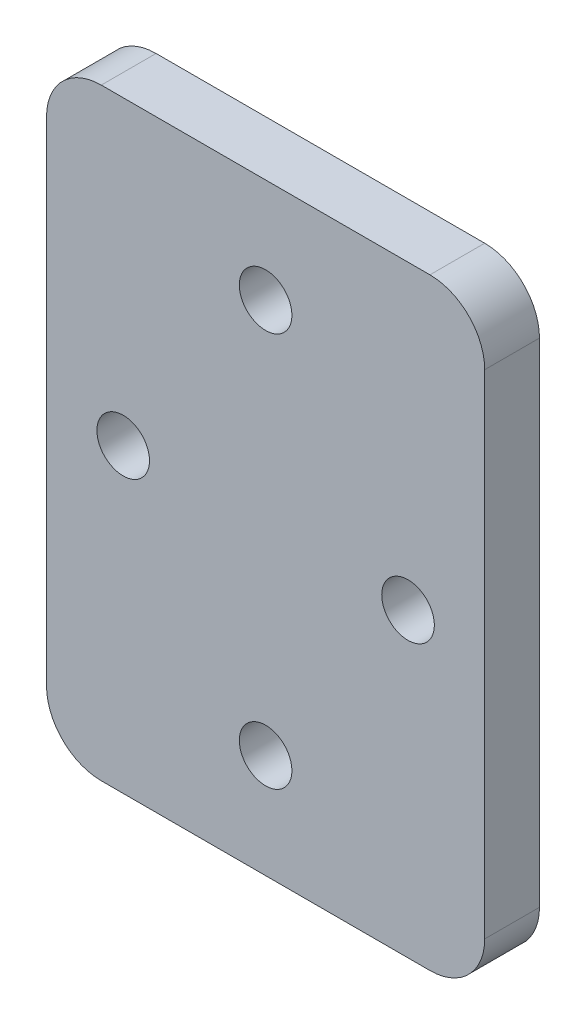
ISO-10303-21;
HEADER;
FILE_DESCRIPTION(('STEP AP214'),'2;1');
FILE_NAME('part.step','',(''),(''),'','','');
FILE_SCHEMA(('AUTOMOTIVE_DESIGN { 1 0 10303 214 1 1 1 1 }'));
ENDSEC;
DATA;
#1=APPLICATION_CONTEXT('core data for automotive mechanical design processes');
#2=APPLICATION_PROTOCOL_DEFINITION('international standard','automotive_design',2000,#1);
#3=PRODUCT_CONTEXT('',#1,'mechanical');
#4=PRODUCT('Part','Part','',(#3));
#5=PRODUCT_RELATED_PRODUCT_CATEGORY('part','',(#4));
#6=PRODUCT_DEFINITION_FORMATION('','',#4);
#7=PRODUCT_DEFINITION_CONTEXT('part definition',#1,'design');
#8=PRODUCT_DEFINITION('design','',#6,#7);
#9=PRODUCT_DEFINITION_SHAPE('','',#8);
#10=(LENGTH_UNIT() NAMED_UNIT(*) SI_UNIT(.MILLI.,.METRE.));
#11=(NAMED_UNIT(*) PLANE_ANGLE_UNIT() SI_UNIT($,.RADIAN.));
#12=(NAMED_UNIT(*) SI_UNIT($,.STERADIAN.) SOLID_ANGLE_UNIT());
#13=UNCERTAINTY_MEASURE_WITH_UNIT(LENGTH_MEASURE(1.E-05),#10,'distance_accuracy_value','');
#14=(GEOMETRIC_REPRESENTATION_CONTEXT(3) GLOBAL_UNCERTAINTY_ASSIGNED_CONTEXT((#13)) GLOBAL_UNIT_ASSIGNED_CONTEXT((#10,
#11,#12)) REPRESENTATION_CONTEXT('',''));
#15=CARTESIAN_POINT('',(0.,0.,0.));
#16=DIRECTION('',(0.,0.,1.));
#17=DIRECTION('',(1.,0.,0.));
#18=AXIS2_PLACEMENT_3D('',#15,#16,#17);
#19=CARTESIAN_POINT('',(0.,0.,5.));
#20=DIRECTION('',(0.,0.,1.));
#21=DIRECTION('',(1.,0.,0.));
#22=AXIS2_PLACEMENT_3D('',#19,#20,#21);
#23=PLANE('',#22);
#24=CARTESIAN_POINT('',(0.,-18.,5.));
#25=DIRECTION('',(0.,0.,1.));
#26=DIRECTION('',(-1.,0.,0.));
#27=AXIS2_PLACEMENT_3D('',#24,#25,#26);
#28=CIRCLE('',#27,2.4);
#29=CARTESIAN_POINT('',(-2.4,-18.,5.));
#30=VERTEX_POINT('',#29);
#31=EDGE_CURVE('E191',#30,#30,#28,.T.);
#32=ORIENTED_EDGE('',*,*,#31,.F.);
#33=EDGE_LOOP('',(#32));
#34=FACE_BOUND('',#33,.T.);
#35=CARTESIAN_POINT('',(0.,18.,5.));
#36=DIRECTION('',(0.,0.,1.));
#37=DIRECTION('',(1.,0.,0.));
#38=AXIS2_PLACEMENT_3D('',#35,#36,#37);
#39=CIRCLE('',#38,2.4);
#40=CARTESIAN_POINT('',(2.4,18.,5.));
#41=VERTEX_POINT('',#40);
#42=EDGE_CURVE('E129',#41,#41,#39,.T.);
#43=ORIENTED_EDGE('',*,*,#42,.F.);
#44=EDGE_LOOP('',(#43));
#45=FACE_BOUND('',#44,.T.);
#46=DIRECTION('',(1.,0.,0.));
#47=VECTOR('',#46,1.);
#48=CARTESIAN_POINT('',(-20.,-27.5,5.));
#49=LINE('',#48,#47);
#50=CARTESIAN_POINT('',(-15.,-27.5,5.));
#51=VERTEX_POINT('',#50);
#52=CARTESIAN_POINT('',(15.,-27.5,5.));
#53=VERTEX_POINT('',#52);
#54=EDGE_CURVE('E138',#51,#53,#49,.T.);
#55=ORIENTED_EDGE('',*,*,#54,.T.);
#56=CARTESIAN_POINT('',(15.,-22.5,5.));
#57=DIRECTION('',(0.,0.,1.));
#58=DIRECTION('',(1.,0.,0.));
#59=AXIS2_PLACEMENT_3D('',#56,#57,#58);
#60=CIRCLE('',#59,5.);
#61=CARTESIAN_POINT('',(20.,-22.5,5.));
#62=VERTEX_POINT('',#61);
#63=EDGE_CURVE('E156',#53,#62,#60,.T.);
#64=ORIENTED_EDGE('',*,*,#63,.T.);
#65=DIRECTION('',(0.,1.,0.));
#66=VECTOR('',#65,1.);
#67=CARTESIAN_POINT('',(20.,27.5,5.));
#68=LINE('',#67,#66);
#69=CARTESIAN_POINT('',(20.,22.5,5.));
#70=VERTEX_POINT('',#69);
#71=EDGE_CURVE('E120',#62,#70,#68,.T.);
#72=ORIENTED_EDGE('',*,*,#71,.T.);
#73=CARTESIAN_POINT('',(15.,22.5,5.));
#74=DIRECTION('',(0.,0.,1.));
#75=DIRECTION('',(1.,0.,0.));
#76=AXIS2_PLACEMENT_3D('',#73,#74,#75);
#77=CIRCLE('',#76,5.);
#78=CARTESIAN_POINT('',(15.,27.5,5.));
#79=VERTEX_POINT('',#78);
#80=EDGE_CURVE('E152',#70,#79,#77,.T.);
#81=ORIENTED_EDGE('',*,*,#80,.T.);
#82=DIRECTION('',(-1.,0.,0.));
#83=VECTOR('',#82,1.);
#84=CARTESIAN_POINT('',(-20.,27.5,5.));
#85=LINE('',#84,#83);
#86=CARTESIAN_POINT('',(-15.,27.5,5.));
#87=VERTEX_POINT('',#86);
#88=EDGE_CURVE('E165',#79,#87,#85,.T.);
#89=ORIENTED_EDGE('',*,*,#88,.T.);
#90=CARTESIAN_POINT('',(-15.,22.5,5.));
#91=DIRECTION('',(0.,0.,1.));
#92=DIRECTION('',(1.,0.,0.));
#93=AXIS2_PLACEMENT_3D('',#90,#91,#92);
#94=CIRCLE('',#93,5.);
#95=CARTESIAN_POINT('',(-20.,22.5,5.));
#96=VERTEX_POINT('',#95);
#97=EDGE_CURVE('E55',#87,#96,#94,.T.);
#98=ORIENTED_EDGE('',*,*,#97,.T.);
#99=DIRECTION('',(0.,-1.,0.));
#100=VECTOR('',#99,1.);
#101=CARTESIAN_POINT('',(-20.,27.5,5.));
#102=LINE('',#101,#100);
#103=CARTESIAN_POINT('',(-20.,-22.5,5.));
#104=VERTEX_POINT('',#103);
#105=EDGE_CURVE('E171',#96,#104,#102,.T.);
#106=ORIENTED_EDGE('',*,*,#105,.T.);
#107=CARTESIAN_POINT('',(-15.,-22.5,5.));
#108=DIRECTION('',(0.,0.,1.));
#109=DIRECTION('',(1.,0.,0.));
#110=AXIS2_PLACEMENT_3D('',#107,#108,#109);
#111=CIRCLE('',#110,5.);
#112=EDGE_CURVE('E154',#104,#51,#111,.T.);
#113=ORIENTED_EDGE('',*,*,#112,.T.);
#114=EDGE_LOOP('',(#55,#64,#72,#81,#89,#98,#106,#113));
#115=FACE_BOUND('',#114,.T.);
#116=CARTESIAN_POINT('',(-13.,0.,5.));
#117=DIRECTION('',(0.,0.,1.));
#118=DIRECTION('',(1.,0.,0.));
#119=AXIS2_PLACEMENT_3D('',#116,#117,#118);
#120=CIRCLE('',#119,2.4);
#121=CARTESIAN_POINT('',(-10.6,0.,5.));
#122=VERTEX_POINT('',#121);
#123=EDGE_CURVE('E186',#122,#122,#120,.T.);
#124=ORIENTED_EDGE('',*,*,#123,.F.);
#125=EDGE_LOOP('',(#124));
#126=FACE_BOUND('',#125,.T.);
#127=CARTESIAN_POINT('',(13.,0.,5.));
#128=DIRECTION('',(0.,0.,1.));
#129=DIRECTION('',(-1.,0.,0.));
#130=AXIS2_PLACEMENT_3D('',#127,#128,#129);
#131=CIRCLE('',#130,2.4);
#132=CARTESIAN_POINT('',(10.6,0.,5.));
#133=VERTEX_POINT('',#132);
#134=EDGE_CURVE('E197',#133,#133,#131,.T.);
#135=ORIENTED_EDGE('',*,*,#134,.F.);
#136=EDGE_LOOP('',(#135));
#137=FACE_BOUND('',#136,.T.);
#138=ADVANCED_FACE('F33',(#34,#45,#115,#126,#137),#23,.T.);
#139=CARTESIAN_POINT('',(0.,0.,0.));
#140=DIRECTION('',(0.,0.,1.));
#141=DIRECTION('',(1.,0.,0.));
#142=AXIS2_PLACEMENT_3D('',#139,#140,#141);
#143=PLANE('',#142);
#144=DIRECTION('',(0.,1.,0.));
#145=VECTOR('',#144,1.);
#146=CARTESIAN_POINT('',(20.,27.5,0.));
#147=LINE('',#146,#145);
#148=CARTESIAN_POINT('',(20.,-22.5,0.));
#149=VERTEX_POINT('',#148);
#150=CARTESIAN_POINT('',(20.,22.5,0.));
#151=VERTEX_POINT('',#150);
#152=EDGE_CURVE('E117',#149,#151,#147,.T.);
#153=ORIENTED_EDGE('',*,*,#152,.F.);
#154=CARTESIAN_POINT('',(15.,-22.5,0.));
#155=DIRECTION('',(0.,0.,1.));
#156=DIRECTION('',(1.,0.,0.));
#157=AXIS2_PLACEMENT_3D('',#154,#155,#156);
#158=CIRCLE('',#157,5.);
#159=CARTESIAN_POINT('',(15.,-27.5,0.));
#160=VERTEX_POINT('',#159);
#161=EDGE_CURVE('E100',#149,#160,#158,.F.);
#162=ORIENTED_EDGE('',*,*,#161,.T.);
#163=DIRECTION('',(1.,0.,0.));
#164=VECTOR('',#163,1.);
#165=CARTESIAN_POINT('',(-20.,-27.5,0.));
#166=LINE('',#165,#164);
#167=CARTESIAN_POINT('',(-15.,-27.5,0.));
#168=VERTEX_POINT('',#167);
#169=EDGE_CURVE('E142',#168,#160,#166,.T.);
#170=ORIENTED_EDGE('',*,*,#169,.F.);
#171=CARTESIAN_POINT('',(-15.,-22.5,0.));
#172=DIRECTION('',(0.,0.,1.));
#173=DIRECTION('',(1.,0.,0.));
#174=AXIS2_PLACEMENT_3D('',#171,#172,#173);
#175=CIRCLE('',#174,5.);
#176=CARTESIAN_POINT('',(-20.,-22.5,0.));
#177=VERTEX_POINT('',#176);
#178=EDGE_CURVE('E111',#168,#177,#175,.F.);
#179=ORIENTED_EDGE('',*,*,#178,.T.);
#180=DIRECTION('',(0.,-1.,0.));
#181=VECTOR('',#180,1.);
#182=CARTESIAN_POINT('',(-20.,27.5,0.));
#183=LINE('',#182,#181);
#184=CARTESIAN_POINT('',(-20.,22.5,0.));
#185=VERTEX_POINT('',#184);
#186=EDGE_CURVE('E132',#185,#177,#183,.T.);
#187=ORIENTED_EDGE('',*,*,#186,.F.);
#188=CARTESIAN_POINT('',(-15.,22.5,0.));
#189=DIRECTION('',(0.,0.,1.));
#190=DIRECTION('',(1.,0.,0.));
#191=AXIS2_PLACEMENT_3D('',#188,#189,#190);
#192=CIRCLE('',#191,5.);
#193=CARTESIAN_POINT('',(-15.,27.5,0.));
#194=VERTEX_POINT('',#193);
#195=EDGE_CURVE('E121',#185,#194,#192,.F.);
#196=ORIENTED_EDGE('',*,*,#195,.T.);
#197=DIRECTION('',(-1.,0.,0.));
#198=VECTOR('',#197,1.);
#199=CARTESIAN_POINT('',(-20.,27.5,0.));
#200=LINE('',#199,#198);
#201=CARTESIAN_POINT('',(15.,27.5,0.));
#202=VERTEX_POINT('',#201);
#203=EDGE_CURVE('E128',#202,#194,#200,.T.);
#204=ORIENTED_EDGE('',*,*,#203,.F.);
#205=CARTESIAN_POINT('',(15.,22.5,0.));
#206=DIRECTION('',(0.,0.,1.));
#207=DIRECTION('',(1.,0.,0.));
#208=AXIS2_PLACEMENT_3D('',#205,#206,#207);
#209=CIRCLE('',#208,5.);
#210=EDGE_CURVE('E127',#202,#151,#209,.F.);
#211=ORIENTED_EDGE('',*,*,#210,.T.);
#212=EDGE_LOOP('',(#153,#162,#170,#179,#187,#196,#204,#211));
#213=FACE_BOUND('',#212,.T.);
#214=CARTESIAN_POINT('',(0.,18.,0.));
#215=DIRECTION('',(0.,0.,1.));
#216=DIRECTION('',(1.,0.,0.));
#217=AXIS2_PLACEMENT_3D('',#214,#215,#216);
#218=CIRCLE('',#217,2.4);
#219=CARTESIAN_POINT('',(2.4,18.,0.));
#220=VERTEX_POINT('',#219);
#221=EDGE_CURVE('E135',#220,#220,#218,.T.);
#222=ORIENTED_EDGE('',*,*,#221,.T.);
#223=EDGE_LOOP('',(#222));
#224=FACE_BOUND('',#223,.T.);
#225=CARTESIAN_POINT('',(-13.,0.,0.));
#226=DIRECTION('',(0.,0.,1.));
#227=DIRECTION('',(1.,0.,0.));
#228=AXIS2_PLACEMENT_3D('',#225,#226,#227);
#229=CIRCLE('',#228,2.4);
#230=CARTESIAN_POINT('',(-10.6,0.,0.));
#231=VERTEX_POINT('',#230);
#232=EDGE_CURVE('E188',#231,#231,#229,.T.);
#233=ORIENTED_EDGE('',*,*,#232,.T.);
#234=EDGE_LOOP('',(#233));
#235=FACE_BOUND('',#234,.T.);
#236=CARTESIAN_POINT('',(0.,-18.,0.));
#237=DIRECTION('',(0.,0.,1.));
#238=DIRECTION('',(-1.,0.,0.));
#239=AXIS2_PLACEMENT_3D('',#236,#237,#238);
#240=CIRCLE('',#239,2.4);
#241=CARTESIAN_POINT('',(-2.4,-18.,0.));
#242=VERTEX_POINT('',#241);
#243=EDGE_CURVE('E194',#242,#242,#240,.T.);
#244=ORIENTED_EDGE('',*,*,#243,.T.);
#245=EDGE_LOOP('',(#244));
#246=FACE_BOUND('',#245,.T.);
#247=CARTESIAN_POINT('',(13.,0.,0.));
#248=DIRECTION('',(0.,0.,1.));
#249=DIRECTION('',(-1.,0.,0.));
#250=AXIS2_PLACEMENT_3D('',#247,#248,#249);
#251=CIRCLE('',#250,2.4);
#252=CARTESIAN_POINT('',(10.6,0.,0.));
#253=VERTEX_POINT('',#252);
#254=EDGE_CURVE('E200',#253,#253,#251,.T.);
#255=ORIENTED_EDGE('',*,*,#254,.T.);
#256=EDGE_LOOP('',(#255));
#257=FACE_BOUND('',#256,.T.);
#258=ADVANCED_FACE('F124',(#213,#224,#235,#246,#257),#143,.F.);
#259=CARTESIAN_POINT('',(20.,27.5,5.));
#260=DIRECTION('',(-1.,0.,0.));
#261=DIRECTION('',(0.,-1.,0.));
#262=AXIS2_PLACEMENT_3D('',#259,#260,#261);
#263=PLANE('',#262);
#264=ORIENTED_EDGE('',*,*,#71,.F.);
#265=DIRECTION('',(0.,0.,-1.));
#266=VECTOR('',#265,1.);
#267=CARTESIAN_POINT('',(20.,-22.5,5.));
#268=LINE('',#267,#266);
#269=EDGE_CURVE('E104',#62,#149,#268,.T.);
#270=ORIENTED_EDGE('',*,*,#269,.T.);
#271=ORIENTED_EDGE('',*,*,#152,.T.);
#272=DIRECTION('',(0.,0.,-1.));
#273=VECTOR('',#272,1.);
#274=CARTESIAN_POINT('',(20.,22.5,5.));
#275=LINE('',#274,#273);
#276=EDGE_CURVE('E122',#151,#70,#275,.F.);
#277=ORIENTED_EDGE('',*,*,#276,.T.);
#278=EDGE_LOOP('',(#264,#270,#271,#277));
#279=FACE_BOUND('',#278,.T.);
#280=ADVANCED_FACE('F116',(#279),#263,.F.);
#281=CARTESIAN_POINT('',(-20.,27.5,5.));
#282=DIRECTION('',(0.,-1.,0.));
#283=DIRECTION('',(0.,0.,-1.));
#284=AXIS2_PLACEMENT_3D('',#281,#282,#283);
#285=PLANE('',#284);
#286=ORIENTED_EDGE('',*,*,#88,.F.);
#287=DIRECTION('',(0.,0.,-1.));
#288=VECTOR('',#287,1.);
#289=CARTESIAN_POINT('',(15.,27.5,5.));
#290=LINE('',#289,#288);
#291=EDGE_CURVE('E11',#79,#202,#290,.T.);
#292=ORIENTED_EDGE('',*,*,#291,.T.);
#293=ORIENTED_EDGE('',*,*,#203,.T.);
#294=DIRECTION('',(0.,0.,-1.));
#295=VECTOR('',#294,1.);
#296=CARTESIAN_POINT('',(-15.,27.5,5.));
#297=LINE('',#296,#295);
#298=EDGE_CURVE('E41',#194,#87,#297,.F.);
#299=ORIENTED_EDGE('',*,*,#298,.T.);
#300=EDGE_LOOP('',(#286,#292,#293,#299));
#301=FACE_BOUND('',#300,.T.);
#302=ADVANCED_FACE('F164',(#301),#285,.F.);
#303=CARTESIAN_POINT('',(-20.,27.5,5.));
#304=DIRECTION('',(1.,0.,0.));
#305=DIRECTION('',(0.,0.,-1.));
#306=AXIS2_PLACEMENT_3D('',#303,#304,#305);
#307=PLANE('',#306);
#308=ORIENTED_EDGE('',*,*,#186,.T.);
#309=DIRECTION('',(0.,0.,-1.));
#310=VECTOR('',#309,1.);
#311=CARTESIAN_POINT('',(-20.,-22.5,5.));
#312=LINE('',#311,#310);
#313=EDGE_CURVE('E48',#177,#104,#312,.F.);
#314=ORIENTED_EDGE('',*,*,#313,.T.);
#315=ORIENTED_EDGE('',*,*,#105,.F.);
#316=DIRECTION('',(0.,0.,-1.));
#317=VECTOR('',#316,1.);
#318=CARTESIAN_POINT('',(-20.,22.5,5.));
#319=LINE('',#318,#317);
#320=EDGE_CURVE('E158',#96,#185,#319,.T.);
#321=ORIENTED_EDGE('',*,*,#320,.T.);
#322=EDGE_LOOP('',(#308,#314,#315,#321));
#323=FACE_BOUND('',#322,.T.);
#324=ADVANCED_FACE('F175',(#323),#307,.F.);
#325=CARTESIAN_POINT('',(-20.,-27.5,5.));
#326=DIRECTION('',(0.,1.,0.));
#327=DIRECTION('',(0.,0.,1.));
#328=AXIS2_PLACEMENT_3D('',#325,#326,#327);
#329=PLANE('',#328);
#330=ORIENTED_EDGE('',*,*,#169,.T.);
#331=DIRECTION('',(0.,0.,-1.));
#332=VECTOR('',#331,1.);
#333=CARTESIAN_POINT('',(15.,-27.5,5.));
#334=LINE('',#333,#332);
#335=EDGE_CURVE('E105',#160,#53,#334,.F.);
#336=ORIENTED_EDGE('',*,*,#335,.T.);
#337=ORIENTED_EDGE('',*,*,#54,.F.);
#338=DIRECTION('',(0.,0.,-1.));
#339=VECTOR('',#338,1.);
#340=CARTESIAN_POINT('',(-15.,-27.5,5.));
#341=LINE('',#340,#339);
#342=EDGE_CURVE('E110',#51,#168,#341,.T.);
#343=ORIENTED_EDGE('',*,*,#342,.T.);
#344=EDGE_LOOP('',(#330,#336,#337,#343));
#345=FACE_BOUND('',#344,.T.);
#346=ADVANCED_FACE('F182',(#345),#329,.F.);
#347=CARTESIAN_POINT('',(0.,18.,5.));
#348=DIRECTION('',(0.,0.,-1.));
#349=DIRECTION('',(-1.,0.,0.));
#350=AXIS2_PLACEMENT_3D('',#347,#348,#349);
#351=CYLINDRICAL_SURFACE('',#350,2.4);
#352=ORIENTED_EDGE('',*,*,#42,.T.);
#353=EDGE_LOOP('',(#352));
#354=FACE_BOUND('',#353,.T.);
#355=ORIENTED_EDGE('',*,*,#221,.F.);
#356=EDGE_LOOP('',(#355));
#357=FACE_BOUND('',#356,.T.);
#358=ADVANCED_FACE('F219',(#354,#357),#351,.F.);
#359=CARTESIAN_POINT('',(-13.,0.,5.));
#360=DIRECTION('',(0.,0.,-1.));
#361=DIRECTION('',(-1.,0.,0.));
#362=AXIS2_PLACEMENT_3D('',#359,#360,#361);
#363=CYLINDRICAL_SURFACE('',#362,2.4);
#364=ORIENTED_EDGE('',*,*,#123,.T.);
#365=EDGE_LOOP('',(#364));
#366=FACE_BOUND('',#365,.T.);
#367=ORIENTED_EDGE('',*,*,#232,.F.);
#368=EDGE_LOOP('',(#367));
#369=FACE_BOUND('',#368,.T.);
#370=ADVANCED_FACE('F311',(#366,#369),#363,.F.);
#371=CARTESIAN_POINT('',(0.,-18.,5.));
#372=DIRECTION('',(0.,0.,-1.));
#373=DIRECTION('',(-1.,0.,0.));
#374=AXIS2_PLACEMENT_3D('',#371,#372,#373);
#375=CYLINDRICAL_SURFACE('',#374,2.4);
#376=ORIENTED_EDGE('',*,*,#31,.T.);
#377=EDGE_LOOP('',(#376));
#378=FACE_BOUND('',#377,.T.);
#379=ORIENTED_EDGE('',*,*,#243,.F.);
#380=EDGE_LOOP('',(#379));
#381=FACE_BOUND('',#380,.T.);
#382=ADVANCED_FACE('F302',(#378,#381),#375,.F.);
#383=CARTESIAN_POINT('',(13.,0.,5.));
#384=DIRECTION('',(0.,0.,-1.));
#385=DIRECTION('',(-1.,0.,0.));
#386=AXIS2_PLACEMENT_3D('',#383,#384,#385);
#387=CYLINDRICAL_SURFACE('',#386,2.4);
#388=ORIENTED_EDGE('',*,*,#134,.T.);
#389=EDGE_LOOP('',(#388));
#390=FACE_BOUND('',#389,.T.);
#391=ORIENTED_EDGE('',*,*,#254,.F.);
#392=EDGE_LOOP('',(#391));
#393=FACE_BOUND('',#392,.T.);
#394=ADVANCED_FACE('F206',(#390,#393),#387,.F.);
#395=CARTESIAN_POINT('',(15.,-22.5,5.));
#396=DIRECTION('',(0.,0.,-1.));
#397=DIRECTION('',(-1.,0.,0.));
#398=AXIS2_PLACEMENT_3D('',#395,#396,#397);
#399=CYLINDRICAL_SURFACE('',#398,5.);
#400=ORIENTED_EDGE('',*,*,#63,.F.);
#401=ORIENTED_EDGE('',*,*,#335,.F.);
#402=ORIENTED_EDGE('',*,*,#161,.F.);
#403=ORIENTED_EDGE('',*,*,#269,.F.);
#404=EDGE_LOOP('',(#400,#401,#402,#403));
#405=FACE_BOUND('',#404,.T.);
#406=ADVANCED_FACE('F103',(#405),#399,.T.);
#407=CARTESIAN_POINT('',(-15.,-22.5,5.));
#408=DIRECTION('',(0.,0.,-1.));
#409=DIRECTION('',(-1.,0.,0.));
#410=AXIS2_PLACEMENT_3D('',#407,#408,#409);
#411=CYLINDRICAL_SURFACE('',#410,5.);
#412=ORIENTED_EDGE('',*,*,#112,.F.);
#413=ORIENTED_EDGE('',*,*,#313,.F.);
#414=ORIENTED_EDGE('',*,*,#178,.F.);
#415=ORIENTED_EDGE('',*,*,#342,.F.);
#416=EDGE_LOOP('',(#412,#413,#414,#415));
#417=FACE_BOUND('',#416,.T.);
#418=ADVANCED_FACE('F179',(#417),#411,.T.);
#419=CARTESIAN_POINT('',(15.,22.5,5.));
#420=DIRECTION('',(0.,0.,-1.));
#421=DIRECTION('',(-1.,0.,0.));
#422=AXIS2_PLACEMENT_3D('',#419,#420,#421);
#423=CYLINDRICAL_SURFACE('',#422,5.);
#424=ORIENTED_EDGE('',*,*,#80,.F.);
#425=ORIENTED_EDGE('',*,*,#276,.F.);
#426=ORIENTED_EDGE('',*,*,#210,.F.);
#427=ORIENTED_EDGE('',*,*,#291,.F.);
#428=EDGE_LOOP('',(#424,#425,#426,#427));
#429=FACE_BOUND('',#428,.T.);
#430=ADVANCED_FACE('F233',(#429),#423,.T.);
#431=CARTESIAN_POINT('',(-15.,22.5,5.));
#432=DIRECTION('',(0.,0.,-1.));
#433=DIRECTION('',(-1.,0.,0.));
#434=AXIS2_PLACEMENT_3D('',#431,#432,#433);
#435=CYLINDRICAL_SURFACE('',#434,5.);
#436=ORIENTED_EDGE('',*,*,#97,.F.);
#437=ORIENTED_EDGE('',*,*,#298,.F.);
#438=ORIENTED_EDGE('',*,*,#195,.F.);
#439=ORIENTED_EDGE('',*,*,#320,.F.);
#440=EDGE_LOOP('',(#436,#437,#438,#439));
#441=FACE_BOUND('',#440,.T.);
#442=ADVANCED_FACE('F35',(#441),#435,.T.);
#443=CLOSED_SHELL('',(#138,#258,#280,#302,#324,#346,#358,#370,#382,#394,#406,#418,#430,#442));
#444=MANIFOLD_SOLID_BREP('B2',#443);
#445=ADVANCED_BREP_SHAPE_REPRESENTATION('',(#18,#444),#14);
#446=SHAPE_DEFINITION_REPRESENTATION(#9,#445);
ENDSEC;
END-ISO-10303-21;
